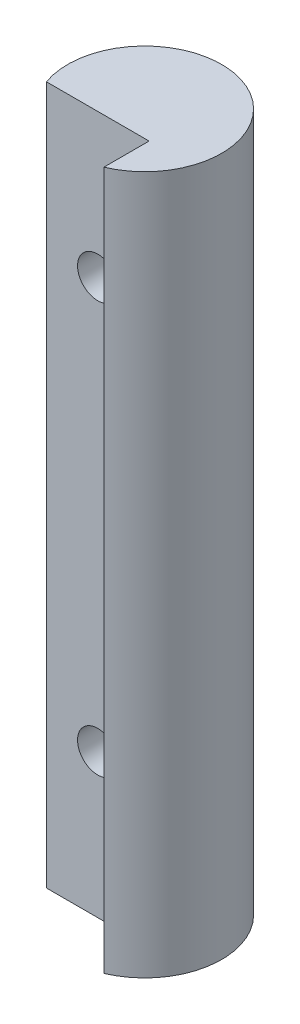
ISO-10303-21;
HEADER;
FILE_DESCRIPTION(('STEP AP214'),'2;1');
FILE_NAME('part.step','',(''),(''),'','','');
FILE_SCHEMA(('AUTOMOTIVE_DESIGN { 1 0 10303 214 1 1 1 1 }'));
ENDSEC;
DATA;
#1=APPLICATION_CONTEXT('core data for automotive mechanical design processes');
#2=APPLICATION_PROTOCOL_DEFINITION('international standard','automotive_design',2000,#1);
#3=PRODUCT_CONTEXT('',#1,'mechanical');
#4=PRODUCT('Part','Part','',(#3));
#5=PRODUCT_RELATED_PRODUCT_CATEGORY('part','',(#4));
#6=PRODUCT_DEFINITION_FORMATION('','',#4);
#7=PRODUCT_DEFINITION_CONTEXT('part definition',#1,'design');
#8=PRODUCT_DEFINITION('design','',#6,#7);
#9=PRODUCT_DEFINITION_SHAPE('','',#8);
#10=(LENGTH_UNIT() NAMED_UNIT(*) SI_UNIT(.MILLI.,.METRE.));
#11=(NAMED_UNIT(*) PLANE_ANGLE_UNIT() SI_UNIT($,.RADIAN.));
#12=(NAMED_UNIT(*) SI_UNIT($,.STERADIAN.) SOLID_ANGLE_UNIT());
#13=UNCERTAINTY_MEASURE_WITH_UNIT(LENGTH_MEASURE(1.E-05),#10,'distance_accuracy_value','');
#14=(GEOMETRIC_REPRESENTATION_CONTEXT(3) GLOBAL_UNCERTAINTY_ASSIGNED_CONTEXT((#13)) GLOBAL_UNIT_ASSIGNED_CONTEXT((#10,
#11,#12)) REPRESENTATION_CONTEXT('',''));
#15=CARTESIAN_POINT('',(0.,0.,0.));
#16=DIRECTION('',(0.,0.,1.));
#17=DIRECTION('',(1.,0.,0.));
#18=AXIS2_PLACEMENT_3D('',#15,#16,#17);
#19=CARTESIAN_POINT('',(0.,43.18,0.));
#20=DIRECTION('',(0.,-1.,0.));
#21=DIRECTION('',(0.,0.,-1.));
#22=AXIS2_PLACEMENT_3D('',#19,#20,#21);
#23=CYLINDRICAL_SURFACE('',#22,4.7625);
#24=CARTESIAN_POINT('',(-0.0651280605345806,34.29,-4.76205466009484));
#25=CARTESIAN_POINT('',(-0.0651297987445939,34.3601806654157,-4.76205543301589));
#26=CARTESIAN_POINT('',(-0.0710549660296462,34.4303820166036,-4.76198487685001));
#27=CARTESIAN_POINT('',(-0.0945979493239045,34.5688208484693,-4.76157454855755));
#28=CARTESIAN_POINT('',(-0.112221659388021,34.637057321095,-4.76123464070729));
#29=CARTESIAN_POINT('',(-0.158662464759697,34.769600879326,-4.75991270568545));
#30=CARTESIAN_POINT('',(-0.187478774401044,34.8339082403693,-4.75893072358108));
#31=CARTESIAN_POINT('',(-0.255472281436603,34.9567513119858,-4.75576419353884));
#32=CARTESIAN_POINT('',(-0.294648306020579,35.0152876748573,-4.75357978169627));
#33=CARTESIAN_POINT('',(-0.382057628477233,35.1247256989463,-4.74735144313241));
#34=CARTESIAN_POINT('',(-0.430260343987756,35.1756521246824,-4.7433137302487));
#35=CARTESIAN_POINT('',(-0.53433163154766,35.2686340536033,-4.73271852640439));
#36=CARTESIAN_POINT('',(-0.590199358655012,35.3106905332599,-4.72616131303422));
#37=CARTESIAN_POINT('',(-0.707159753996498,35.3843475712688,-4.71007124589263));
#38=CARTESIAN_POINT('',(-0.768185759585653,35.4160616242744,-4.70057308855907));
#39=CARTESIAN_POINT('',(-0.894074797680816,35.4689296096876,-4.67826025268321));
#40=CARTESIAN_POINT('',(-0.958937628722125,35.4900840960091,-4.66544574815721));
#41=CARTESIAN_POINT('',(-1.09053214917541,35.5215176857469,-4.63645183400836));
#42=CARTESIAN_POINT('',(-1.15726450630432,35.5317928513549,-4.62027120853993));
#43=CARTESIAN_POINT('',(-1.29067961156811,35.5415507541323,-4.58479232176652));
#44=CARTESIAN_POINT('',(-1.35736234855188,35.541031539633,-4.5654934973041));
#45=CARTESIAN_POINT('',(-1.49164080214462,35.529381448231,-4.52344558732496));
#46=CARTESIAN_POINT('',(-1.55916540653804,35.5178246979701,-4.50058896678677));
#47=CARTESIAN_POINT('',(-1.69076422465707,35.4841589403332,-4.45282280735539));
#48=CARTESIAN_POINT('',(-1.75483728772094,35.4620464378532,-4.42791259075989));
#49=CARTESIAN_POINT('',(-1.88272080876343,35.4060459255168,-4.37514479021686));
#50=CARTESIAN_POINT('',(-1.94617417127887,35.3714192801465,-4.34720454535606));
#51=CARTESIAN_POINT('',(-2.06626452665743,35.2917444986645,-4.29142733151653));
#52=CARTESIAN_POINT('',(-2.12289742080378,35.2466901431301,-4.26359043428508));
#53=CARTESIAN_POINT('',(-2.2302564981634,35.1448376214998,-4.20846258276075));
#54=CARTESIAN_POINT('',(-2.28062341738714,35.0876173675177,-4.18124672756108));
#55=CARTESIAN_POINT('',(-2.37076442193219,34.9637855639081,-4.13080573725348));
#56=CARTESIAN_POINT('',(-2.41054311128402,34.8971781154039,-4.10757886919682));
#57=CARTESIAN_POINT('',(-2.47519981515964,34.7611588208654,-4.06892083731522));
#58=CARTESIAN_POINT('',(-2.50093728579861,34.6922845549317,-4.05305227727552));
#59=CARTESIAN_POINT('',(-2.54002562475447,34.5499033708256,-4.02867512940235));
#60=CARTESIAN_POINT('',(-2.55339754941002,34.4764045562942,-4.02015403181753));
#61=CARTESIAN_POINT('',(-2.56577345415972,34.3390257466516,-4.01226261357098));
#62=CARTESIAN_POINT('',(-2.566648294844,34.2753767309729,-4.01170087096489));
#63=CARTESIAN_POINT('',(-2.55875516044308,34.1489319669513,-4.01674009975388));
#64=CARTESIAN_POINT('',(-2.54998844006968,34.0861361086586,-4.02234026926395));
#65=CARTESIAN_POINT('',(-2.52411268759652,33.9669535950441,-4.03862273432121));
#66=CARTESIAN_POINT('',(-2.50752499234409,33.9104072435606,-4.04898653329316));
#67=CARTESIAN_POINT('',(-2.46698617870378,33.8009914314426,-4.07381246759009));
#68=CARTESIAN_POINT('',(-2.44303325834748,33.7481228744993,-4.08827560578736));
#69=CARTESIAN_POINT('',(-2.38605571454002,33.6422712128776,-4.12181163045024));
#70=CARTESIAN_POINT('',(-2.35239894614311,33.5897256386483,-4.14118631712175));
#71=CARTESIAN_POINT('',(-2.27825366314636,33.4908031561765,-4.1824355755871));
#72=CARTESIAN_POINT('',(-2.23776133879768,33.4444297138475,-4.20431153924392));
#73=CARTESIAN_POINT('',(-2.14457391179227,33.3522320096181,-4.25268618520403));
#74=CARTESIAN_POINT('',(-2.09096144472905,33.3074437507191,-4.27939748162949));
#75=CARTESIAN_POINT('',(-1.97715162570867,33.2274236381527,-4.33315620765059));
#76=CARTESIAN_POINT('',(-1.91695082893796,33.1921968176584,-4.36020380647303));
#77=CARTESIAN_POINT('',(-1.78624939432312,33.1297464905683,-4.41544204506483));
#78=CARTESIAN_POINT('',(-1.71531148949824,33.1033636806424,-4.4435568012239));
#79=CARTESIAN_POINT('',(-1.56896016836813,33.0636995858091,-4.49731478267389));
#80=CARTESIAN_POINT('',(-1.49354756701433,33.0504159229447,-4.52295845579061));
#81=CARTESIAN_POINT('',(-1.34286483944348,33.0380974390443,-4.56991766863307));
#82=CARTESIAN_POINT('',(-1.26766621635121,33.038623590458,-4.59134477971017));
#83=CARTESIAN_POINT('',(-1.117579482226,33.0534113971622,-4.63016420562713));
#84=CARTESIAN_POINT('',(-1.0426912279679,33.0676657857521,-4.64755864901583));
#85=CARTESIAN_POINT('',(-0.901468203944166,33.1083160504822,-4.67691980867894));
#86=CARTESIAN_POINT('',(-0.834912452254591,33.1337249828704,-4.6891949995959));
#87=CARTESIAN_POINT('',(-0.706659634005276,33.1957712792487,-4.71022947785537));
#88=CARTESIAN_POINT('',(-0.644961450330825,33.23240605205,-4.71898957548781));
#89=CARTESIAN_POINT('',(-0.530843672955081,33.3142272430068,-4.73315896213037));
#90=CARTESIAN_POINT('',(-0.47815260073015,33.3590154767653,-4.73868769022512));
#91=CARTESIAN_POINT('',(-0.380780986929213,33.4567803166476,-4.74750533412474));
#92=CARTESIAN_POINT('',(-0.336101179974331,33.5097576728732,-4.75079404460064));
#93=CARTESIAN_POINT('',(-0.255988522592185,33.6225276866288,-4.75578550933461));
#94=CARTESIAN_POINT('',(-0.220575950248995,33.6823348851501,-4.75748480627713));
#95=CARTESIAN_POINT('',(-0.160144548975604,33.8069820772063,-4.75990332876355));
#96=CARTESIAN_POINT('',(-0.135121251611707,33.8718198927984,-4.76062297595955));
#97=CARTESIAN_POINT('',(-0.098910823506761,33.9952947961192,-4.76150191200019));
#98=CARTESIAN_POINT('',(-0.0862657402619386,34.0535090025903,-4.76172614374641));
#99=CARTESIAN_POINT('',(-0.0693735611813101,34.1711438487923,-4.76200219176691));
#100=CARTESIAN_POINT('',(-0.0651265884571949,34.2305645061963,-4.76205400551364));
#101=CARTESIAN_POINT('',(-0.0651280605345806,34.29,-4.76205466009484));
#102=B_SPLINE_CURVE_WITH_KNOTS('',3,(#24,#25,#26,#27,#28,#29,#30,#31,#32,#33,#34,#35,#36,#37,
#38,#39,#40,#41,#42,#43,#44,#45,#46,#47,#48,#49,#50,#51,#52,#53,#54,#55,#56,#57,#58,#59,#60,#61,
#62,#63,#64,#65,#66,#67,#68,#69,#70,#71,#72,#73,#74,#75,#76,#77,#78,#79,#80,#81,#82,#83,#84,#85,
#86,#87,#88,#89,#90,#91,#92,#93,#94,#95,#96,#97,#98,#99,#100,#101),.UNSPECIFIED.,.T.,.F.,(4,2,2,
2,2,2,2,2,2,2,2,2,2,2,2,2,2,2,2,2,2,2,2,2,2,2,2,2,2,2,2,2,2,2,2,2,2,2,4),(0.,0.210329862714904,
0.42076577604496,0.631186920463161,0.841584253560124,1.05128125203229,1.26095515338841,
1.46824400832164,1.67552198854074,1.88287496813021,2.09026543832579,2.30599543057932,
2.52179690256253,2.75327270197911,2.98488691843393,3.22647260374774,3.4679530692445,
3.69223532113143,3.91613495292443,4.10609137328509,4.29602307644883,4.47477669464701,
4.65357408136641,4.84883178576853,5.04419867715788,5.26763258969162,5.49118389147701,
5.73220726002571,5.97318686627448,6.20651505391457,6.43971980292807,6.65549706766123,
6.87122456338107,7.07836990556516,7.28553423296597,7.49314814636015,7.70067267214451,
7.8787968880301,8.05692371509959),.UNSPECIFIED.);
#103=CARTESIAN_POINT('',(-0.0651280605345806,34.29,-4.76205466009484));
#104=VERTEX_POINT('',#103);
#105=EDGE_CURVE('E39',#104,#104,#102,.T.);
#106=ORIENTED_EDGE('',*,*,#105,.T.);
#107=EDGE_LOOP('',(#106));
#108=FACE_BOUND('',#107,.T.);
#109=CARTESIAN_POINT('',(-0.0651280605345806,8.89,-4.76205466009484));
#110=CARTESIAN_POINT('',(-0.0651297987445939,8.96018066541571,-4.76205543301589));
#111=CARTESIAN_POINT('',(-0.0710549660296458,9.03038201660358,-4.76198487685001));
#112=CARTESIAN_POINT('',(-0.0945979493239032,9.16882084846931,-4.76157454855755));
#113=CARTESIAN_POINT('',(-0.11222165938802,9.23705732109499,-4.76123464070729));
#114=CARTESIAN_POINT('',(-0.158662464759698,9.36960087932602,-4.75991270568545));
#115=CARTESIAN_POINT('',(-0.187478774401046,9.43390824036934,-4.75893072358108));
#116=CARTESIAN_POINT('',(-0.255472281436608,9.55675131198584,-4.75576419353884));
#117=CARTESIAN_POINT('',(-0.294648306020584,9.61528767485729,-4.75357978169627));
#118=CARTESIAN_POINT('',(-0.382057628477236,9.72472569894631,-4.74735144313241));
#119=CARTESIAN_POINT('',(-0.430260343987758,9.77565212468235,-4.7433137302487));
#120=CARTESIAN_POINT('',(-0.534331631547659,9.86863405360331,-4.73271852640439));
#121=CARTESIAN_POINT('',(-0.590199358655009,9.91069053325987,-4.72616131303422));
#122=CARTESIAN_POINT('',(-0.707159753996495,9.98434757126885,-4.71007124589263));
#123=CARTESIAN_POINT('',(-0.768185759585652,10.0160616242744,-4.70057308855907));
#124=CARTESIAN_POINT('',(-0.894074797680815,10.0689296096875,-4.67826025268321));
#125=CARTESIAN_POINT('',(-0.958937628722124,10.0900840960091,-4.66544574815721));
#126=CARTESIAN_POINT('',(-1.09053214917541,10.1215176857468,-4.63645183400836));
#127=CARTESIAN_POINT('',(-1.15726450630432,10.1317928513549,-4.62027120853993));
#128=CARTESIAN_POINT('',(-1.29067961156811,10.1415507541323,-4.58479232176652));
#129=CARTESIAN_POINT('',(-1.35736234855188,10.141031539633,-4.5654934973041));
#130=CARTESIAN_POINT('',(-1.49164080214462,10.129381448231,-4.52344558732496));
#131=CARTESIAN_POINT('',(-1.55916540653804,10.1178246979701,-4.50058896678677));
#132=CARTESIAN_POINT('',(-1.69076422465707,10.0841589403332,-4.45282280735539));
#133=CARTESIAN_POINT('',(-1.75483728772094,10.0620464378532,-4.42791259075989));
#134=CARTESIAN_POINT('',(-1.88272080876343,10.0060459255168,-4.37514479021686));
#135=CARTESIAN_POINT('',(-1.94617417127887,9.97141928014653,-4.34720454535606));
#136=CARTESIAN_POINT('',(-2.06626452665743,9.89174449866451,-4.29142733151653));
#137=CARTESIAN_POINT('',(-2.12289742080378,9.84669014313014,-4.26359043428508));
#138=CARTESIAN_POINT('',(-2.2302564981634,9.74483762149983,-4.20846258276075));
#139=CARTESIAN_POINT('',(-2.28062341738714,9.68761736751767,-4.18124672756108));
#140=CARTESIAN_POINT('',(-2.37076442193219,9.56378556390813,-4.13080573725348));
#141=CARTESIAN_POINT('',(-2.41054311128402,9.49717811540393,-4.10757886919682));
#142=CARTESIAN_POINT('',(-2.47519981515964,9.36115882086539,-4.06892083731522));
#143=CARTESIAN_POINT('',(-2.50093728579861,9.29228455493171,-4.05305227727553));
#144=CARTESIAN_POINT('',(-2.54002562475447,9.14990337082558,-4.02867512940235));
#145=CARTESIAN_POINT('',(-2.55339754941002,9.07640455629419,-4.02015403181753));
#146=CARTESIAN_POINT('',(-2.56577345415972,8.9390257466516,-4.01226261357098));
#147=CARTESIAN_POINT('',(-2.566648294844,8.87537673097288,-4.01170087096489));
#148=CARTESIAN_POINT('',(-2.55875516044308,8.74893196695127,-4.01674009975388));
#149=CARTESIAN_POINT('',(-2.54998844006968,8.68613610865859,-4.02234026926395));
#150=CARTESIAN_POINT('',(-2.52411268759651,8.56695359504406,-4.03862273432121));
#151=CARTESIAN_POINT('',(-2.50752499234409,8.51040724356058,-4.04898653329316));
#152=CARTESIAN_POINT('',(-2.46698617870377,8.40099143144259,-4.07381246759009));
#153=CARTESIAN_POINT('',(-2.44303325834748,8.34812287449931,-4.08827560578736));
#154=CARTESIAN_POINT('',(-2.38605571454001,8.24227121287755,-4.12181163045024));
#155=CARTESIAN_POINT('',(-2.35239894614311,8.18972563864827,-4.14118631712175));
#156=CARTESIAN_POINT('',(-2.27825366314636,8.0908031561765,-4.1824355755871));
#157=CARTESIAN_POINT('',(-2.23776133879768,8.0444297138475,-4.20431153924392));
#158=CARTESIAN_POINT('',(-2.14457391179227,7.95223200961807,-4.25268618520402));
#159=CARTESIAN_POINT('',(-2.09096144472905,7.90744375071907,-4.27939748162949));
#160=CARTESIAN_POINT('',(-1.97715162570867,7.8274236381527,-4.33315620765059));
#161=CARTESIAN_POINT('',(-1.91695082893795,7.79219681765845,-4.36020380647303));
#162=CARTESIAN_POINT('',(-1.78624939432312,7.72974649056826,-4.41544204506483));
#163=CARTESIAN_POINT('',(-1.71531148949824,7.70336368064236,-4.4435568012239));
#164=CARTESIAN_POINT('',(-1.56896016836813,7.66369958580912,-4.49731478267389));
#165=CARTESIAN_POINT('',(-1.49354756701433,7.65041592294468,-4.52295845579061));
#166=CARTESIAN_POINT('',(-1.34286483944348,7.63809743904432,-4.56991766863307));
#167=CARTESIAN_POINT('',(-1.26766621635121,7.63862359045804,-4.59134477971017));
#168=CARTESIAN_POINT('',(-1.117579482226,7.65341139716224,-4.63016420562713));
#169=CARTESIAN_POINT('',(-1.0426912279679,7.66766578575206,-4.64755864901583));
#170=CARTESIAN_POINT('',(-0.901468203944167,7.70831605048215,-4.67691980867895));
#171=CARTESIAN_POINT('',(-0.834912452254593,7.73372498287036,-4.6891949995959));
#172=CARTESIAN_POINT('',(-0.706659634005278,7.7957712792487,-4.71022947785537));
#173=CARTESIAN_POINT('',(-0.644961450330826,7.83240605205,-4.71898957548781));
#174=CARTESIAN_POINT('',(-0.53084367295508,7.91422724300682,-4.73315896213037));
#175=CARTESIAN_POINT('',(-0.478152600730148,7.95901547676526,-4.73868769022512));
#176=CARTESIAN_POINT('',(-0.38078098692921,8.05678031664755,-4.74750533412474));
#177=CARTESIAN_POINT('',(-0.33610117997433,8.10975767287318,-4.75079404460064));
#178=CARTESIAN_POINT('',(-0.255988522592185,8.22252768662879,-4.75578550933461));
#179=CARTESIAN_POINT('',(-0.220575950248992,8.28233488515006,-4.75748480627713));
#180=CARTESIAN_POINT('',(-0.160144548975601,8.40698207720629,-4.75990332876355));
#181=CARTESIAN_POINT('',(-0.135121251611705,8.47181989279843,-4.76062297595955));
#182=CARTESIAN_POINT('',(-0.0989108235067599,8.59529479611924,-4.76150191200019));
#183=CARTESIAN_POINT('',(-0.0862657402619375,8.65350900259025,-4.76172614374641));
#184=CARTESIAN_POINT('',(-0.0693735611813097,8.77114384879228,-4.76200219176691));
#185=CARTESIAN_POINT('',(-0.0651265884571949,8.8305645061963,-4.76205400551364));
#186=CARTESIAN_POINT('',(-0.0651280605345806,8.89,-4.76205466009484));
#187=B_SPLINE_CURVE_WITH_KNOTS('',3,(#109,#110,#111,#112,#113,#114,#115,#116,#117,#118,#119,
#120,#121,#122,#123,#124,#125,#126,#127,#128,#129,#130,#131,#132,#133,#134,#135,#136,#137,#138,
#139,#140,#141,#142,#143,#144,#145,#146,#147,#148,#149,#150,#151,#152,#153,#154,#155,#156,#157,
#158,#159,#160,#161,#162,#163,#164,#165,#166,#167,#168,#169,#170,#171,#172,#173,#174,#175,#176,
#177,#178,#179,#180,#181,#182,#183,#184,#185,#186),.UNSPECIFIED.,.T.,.F.,(4,2,2,2,2,2,2,2,2,2,2,
2,2,2,2,2,2,2,2,2,2,2,2,2,2,2,2,2,2,2,2,2,2,2,2,2,2,2,4),(0.,0.210329862714897,
0.420765776044958,0.631186920463175,0.841584253560129,1.05128125203229,1.26095515338841,
1.46824400832164,1.67552198854074,1.88287496813021,2.09026543832579,2.30599543057932,
2.52179690256252,2.75327270197911,2.98488691843392,3.22647260374774,3.46795306924449,
3.69223532113143,3.91613495292443,4.10609137328509,4.29602307644883,4.47477669464701,
4.65357408136641,4.84883178576853,5.04419867715788,5.26763258969161,5.49118389147701,
5.73220726002571,5.97318686627448,6.20651505391457,6.43971980292807,6.65549706766123,
6.87122456338107,7.07836990556516,7.28553423296598,7.49314814636015,7.70067267214452,
7.87879688803011,8.05692371509959),.UNSPECIFIED.);
#188=CARTESIAN_POINT('',(-0.0651280605345806,8.89,-4.76205466009484));
#189=VERTEX_POINT('',#188);
#190=EDGE_CURVE('E91',#189,#189,#187,.T.);
#191=ORIENTED_EDGE('',*,*,#190,.T.);
#192=EDGE_LOOP('',(#191));
#193=FACE_BOUND('',#192,.T.);
#194=CARTESIAN_POINT('',(0.,43.18,0.));
#195=DIRECTION('',(0.,1.,0.));
#196=DIRECTION('',(0.,0.,1.));
#197=AXIS2_PLACEMENT_3D('',#194,#195,#196);
#198=CIRCLE('',#197,4.7625);
#199=CARTESIAN_POINT('',(1.85987193946542,43.18,4.38432236711548));
#200=VERTEX_POINT('',#199);
#201=CARTESIAN_POINT('',(-4.49012806053458,43.18,1.5875));
#202=VERTEX_POINT('',#201);
#203=EDGE_CURVE('E11',#200,#202,#198,.T.);
#204=ORIENTED_EDGE('',*,*,#203,.F.);
#205=DIRECTION('',(0.,-1.,0.));
#206=VECTOR('',#205,1.);
#207=CARTESIAN_POINT('',(1.85987193946542,43.18,4.38432236711548));
#208=LINE('',#207,#206);
#209=CARTESIAN_POINT('',(1.85987193946542,0.,4.38432236711548));
#210=VERTEX_POINT('',#209);
#211=EDGE_CURVE('E63',#210,#200,#208,.F.);
#212=ORIENTED_EDGE('',*,*,#211,.F.);
#213=CARTESIAN_POINT('',(0.,0.,0.));
#214=DIRECTION('',(0.,1.,0.));
#215=DIRECTION('',(0.,0.,1.));
#216=AXIS2_PLACEMENT_3D('',#213,#214,#215);
#217=CIRCLE('',#216,4.7625);
#218=CARTESIAN_POINT('',(-4.49012806053458,0.,1.5875));
#219=VERTEX_POINT('',#218);
#220=EDGE_CURVE('E47',#210,#219,#217,.T.);
#221=ORIENTED_EDGE('',*,*,#220,.T.);
#222=DIRECTION('',(0.,-1.,0.));
#223=VECTOR('',#222,1.);
#224=CARTESIAN_POINT('',(-4.49012806053458,43.18,1.5875));
#225=LINE('',#224,#223);
#226=EDGE_CURVE('E55',#202,#219,#225,.T.);
#227=ORIENTED_EDGE('',*,*,#226,.F.);
#228=EDGE_LOOP('',(#204,#212,#221,#227));
#229=FACE_BOUND('',#228,.T.);
#230=ADVANCED_FACE('F35',(#108,#193,#229),#23,.T.);
#231=CARTESIAN_POINT('',(0.,43.18,0.));
#232=DIRECTION('',(0.,1.,0.));
#233=DIRECTION('',(0.,0.,1.));
#234=AXIS2_PLACEMENT_3D('',#231,#232,#233);
#235=PLANE('',#234);
#236=DIRECTION('',(0.,0.,1.));
#237=VECTOR('',#236,1.);
#238=CARTESIAN_POINT('',(1.85987193946542,43.18,1.5875));
#239=LINE('',#238,#237);
#240=CARTESIAN_POINT('',(1.85987193946542,43.18,1.5875));
#241=VERTEX_POINT('',#240);
#242=EDGE_CURVE('E81',#241,#200,#239,.T.);
#243=ORIENTED_EDGE('',*,*,#242,.T.);
#244=ORIENTED_EDGE('',*,*,#203,.T.);
#245=DIRECTION('',(1.,0.,0.));
#246=VECTOR('',#245,1.);
#247=CARTESIAN_POINT('',(1.85987193946542,43.18,1.5875));
#248=LINE('',#247,#246);
#249=EDGE_CURVE('E86',#202,#241,#248,.T.);
#250=ORIENTED_EDGE('',*,*,#249,.T.);
#251=EDGE_LOOP('',(#243,#244,#250));
#252=FACE_BOUND('',#251,.T.);
#253=ADVANCED_FACE('F110',(#252),#235,.T.);
#254=CARTESIAN_POINT('',(0.,0.,0.));
#255=DIRECTION('',(0.,1.,0.));
#256=DIRECTION('',(0.,0.,1.));
#257=AXIS2_PLACEMENT_3D('',#254,#255,#256);
#258=PLANE('',#257);
#259=ORIENTED_EDGE('',*,*,#220,.F.);
#260=DIRECTION('',(0.,0.,1.));
#261=VECTOR('',#260,1.);
#262=CARTESIAN_POINT('',(1.85987193946542,0.,1.5875));
#263=LINE('',#262,#261);
#264=CARTESIAN_POINT('',(1.85987193946542,0.,1.5875));
#265=VERTEX_POINT('',#264);
#266=EDGE_CURVE('E75',#265,#210,#263,.T.);
#267=ORIENTED_EDGE('',*,*,#266,.F.);
#268=DIRECTION('',(1.,0.,0.));
#269=VECTOR('',#268,1.);
#270=CARTESIAN_POINT('',(1.85987193946542,0.,1.5875));
#271=LINE('',#270,#269);
#272=EDGE_CURVE('E80',#219,#265,#271,.T.);
#273=ORIENTED_EDGE('',*,*,#272,.F.);
#274=EDGE_LOOP('',(#259,#267,#273));
#275=FACE_BOUND('',#274,.T.);
#276=ADVANCED_FACE('F88',(#275),#258,.F.);
#277=CARTESIAN_POINT('',(1.85987193946542,43.181,1.5875));
#278=DIRECTION('',(1.,0.,0.));
#279=DIRECTION('',(0.,0.,-1.));
#280=AXIS2_PLACEMENT_3D('',#277,#278,#279);
#281=PLANE('',#280);
#282=ORIENTED_EDGE('',*,*,#211,.T.);
#283=ORIENTED_EDGE('',*,*,#242,.F.);
#284=DIRECTION('',(0.,-1.,0.));
#285=VECTOR('',#284,1.);
#286=CARTESIAN_POINT('',(1.85987193946542,43.181,1.5875));
#287=LINE('',#286,#285);
#288=EDGE_CURVE('E77',#241,#265,#287,.T.);
#289=ORIENTED_EDGE('',*,*,#288,.T.);
#290=ORIENTED_EDGE('',*,*,#266,.T.);
#291=EDGE_LOOP('',(#282,#283,#289,#290));
#292=FACE_BOUND('',#291,.T.);
#293=ADVANCED_FACE('F76',(#292),#281,.F.);
#294=CARTESIAN_POINT('',(1.85987193946542,43.181,1.5875));
#295=DIRECTION('',(0.,0.,-1.));
#296=DIRECTION('',(-1.,0.,0.));
#297=AXIS2_PLACEMENT_3D('',#294,#295,#296);
#298=PLANE('',#297);
#299=CARTESIAN_POINT('',(-1.31512806053458,34.29,1.5875));
#300=DIRECTION('',(0.,0.,1.));
#301=DIRECTION('',(1.,0.,0.));
#302=AXIS2_PLACEMENT_3D('',#299,#300,#301);
#303=CIRCLE('',#302,1.25);
#304=CARTESIAN_POINT('',(-0.0651280605345813,34.29,1.5875));
#305=VERTEX_POINT('',#304);
#306=EDGE_CURVE('E126',#305,#305,#303,.T.);
#307=ORIENTED_EDGE('',*,*,#306,.F.);
#308=EDGE_LOOP('',(#307));
#309=FACE_BOUND('',#308,.T.);
#310=CARTESIAN_POINT('',(-1.31512806053458,8.89,1.5875));
#311=DIRECTION('',(0.,0.,1.));
#312=DIRECTION('',(1.,0.,0.));
#313=AXIS2_PLACEMENT_3D('',#310,#311,#312);
#314=CIRCLE('',#313,1.25);
#315=CARTESIAN_POINT('',(-0.0651280605345813,8.89,1.5875));
#316=VERTEX_POINT('',#315);
#317=EDGE_CURVE('E96',#316,#316,#314,.T.);
#318=ORIENTED_EDGE('',*,*,#317,.F.);
#319=EDGE_LOOP('',(#318));
#320=FACE_BOUND('',#319,.T.);
#321=ORIENTED_EDGE('',*,*,#226,.T.);
#322=ORIENTED_EDGE('',*,*,#272,.T.);
#323=ORIENTED_EDGE('',*,*,#288,.F.);
#324=ORIENTED_EDGE('',*,*,#249,.F.);
#325=EDGE_LOOP('',(#321,#322,#323,#324));
#326=FACE_BOUND('',#325,.T.);
#327=ADVANCED_FACE('F102',(#309,#320,#326),#298,.F.);
#328=CARTESIAN_POINT('',(-1.31512806053458,8.89,1.5875));
#329=DIRECTION('',(0.,0.,1.));
#330=DIRECTION('',(1.,0.,0.));
#331=AXIS2_PLACEMENT_3D('',#328,#329,#330);
#332=CYLINDRICAL_SURFACE('',#331,1.25);
#333=ORIENTED_EDGE('',*,*,#317,.T.);
#334=EDGE_LOOP('',(#333));
#335=FACE_BOUND('',#334,.T.);
#336=ORIENTED_EDGE('',*,*,#190,.F.);
#337=EDGE_LOOP('',(#336));
#338=FACE_BOUND('',#337,.T.);
#339=ADVANCED_FACE('F97',(#335,#338),#332,.F.);
#340=CARTESIAN_POINT('',(-1.31512806053458,34.29,1.5875));
#341=DIRECTION('',(0.,0.,1.));
#342=DIRECTION('',(1.,0.,0.));
#343=AXIS2_PLACEMENT_3D('',#340,#341,#342);
#344=CYLINDRICAL_SURFACE('',#343,1.25);
#345=ORIENTED_EDGE('',*,*,#306,.T.);
#346=EDGE_LOOP('',(#345));
#347=FACE_BOUND('',#346,.T.);
#348=ORIENTED_EDGE('',*,*,#105,.F.);
#349=EDGE_LOOP('',(#348));
#350=FACE_BOUND('',#349,.T.);
#351=ADVANCED_FACE('F101',(#347,#350),#344,.F.);
#352=CLOSED_SHELL('',(#230,#253,#276,#293,#327,#339,#351));
#353=MANIFOLD_SOLID_BREP('B2',#352);
#354=ADVANCED_BREP_SHAPE_REPRESENTATION('',(#18,#353),#14);
#355=SHAPE_DEFINITION_REPRESENTATION(#9,#354);
ENDSEC;
END-ISO-10303-21;
